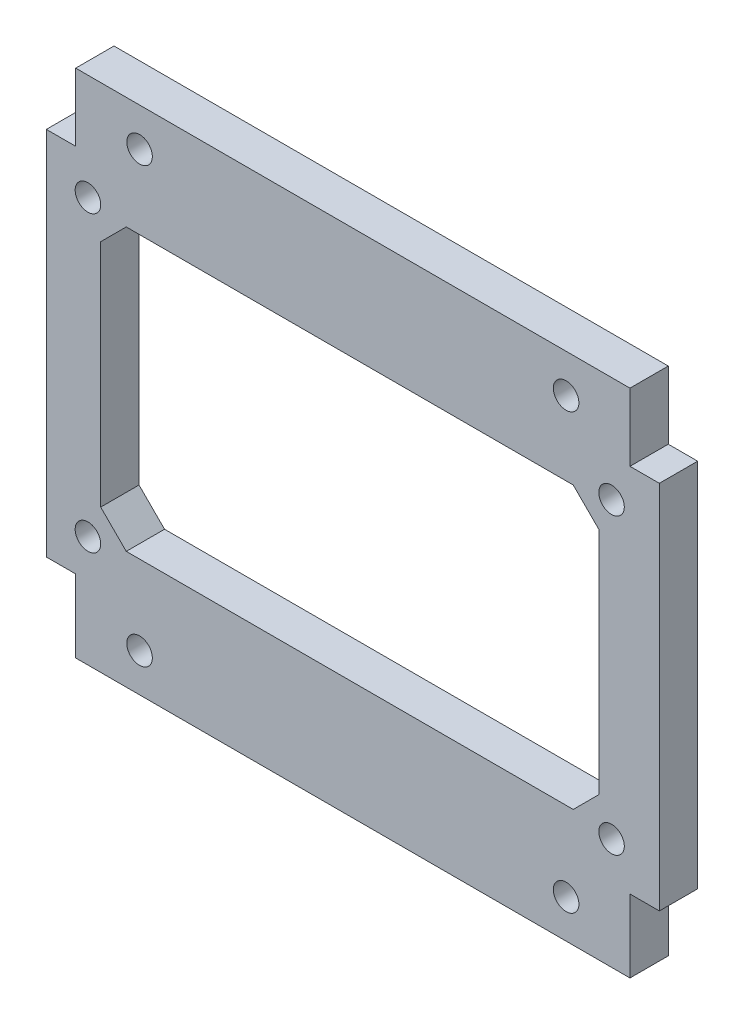
ISO-10303-21;
HEADER;
FILE_DESCRIPTION(('STEP AP214'),'2;1');
FILE_NAME('part.step','',(''),(''),'','','');
FILE_SCHEMA(('AUTOMOTIVE_DESIGN { 1 0 10303 214 1 1 1 1 }'));
ENDSEC;
DATA;
#1=APPLICATION_CONTEXT('core data for automotive mechanical design processes');
#2=APPLICATION_PROTOCOL_DEFINITION('international standard','automotive_design',2000,#1);
#3=PRODUCT_CONTEXT('',#1,'mechanical');
#4=PRODUCT('Part','Part','',(#3));
#5=PRODUCT_RELATED_PRODUCT_CATEGORY('part','',(#4));
#6=PRODUCT_DEFINITION_FORMATION('','',#4);
#7=PRODUCT_DEFINITION_CONTEXT('part definition',#1,'design');
#8=PRODUCT_DEFINITION('design','',#6,#7);
#9=PRODUCT_DEFINITION_SHAPE('','',#8);
#10=(LENGTH_UNIT() NAMED_UNIT(*) SI_UNIT(.MILLI.,.METRE.));
#11=(NAMED_UNIT(*) PLANE_ANGLE_UNIT() SI_UNIT($,.RADIAN.));
#12=(NAMED_UNIT(*) SI_UNIT($,.STERADIAN.) SOLID_ANGLE_UNIT());
#13=UNCERTAINTY_MEASURE_WITH_UNIT(LENGTH_MEASURE(1.E-05),#10,'distance_accuracy_value','');
#14=(GEOMETRIC_REPRESENTATION_CONTEXT(3) GLOBAL_UNCERTAINTY_ASSIGNED_CONTEXT((#13)) GLOBAL_UNIT_ASSIGNED_CONTEXT((#10,
#11,#12)) REPRESENTATION_CONTEXT('',''));
#15=CARTESIAN_POINT('',(0.,0.,0.));
#16=DIRECTION('',(0.,0.,1.));
#17=DIRECTION('',(1.,0.,0.));
#18=AXIS2_PLACEMENT_3D('',#15,#16,#17);
#19=CARTESIAN_POINT('',(2.7,0.,3.));
#20=DIRECTION('',(1.,0.,0.));
#21=DIRECTION('',(0.,0.,-1.));
#22=AXIS2_PLACEMENT_3D('',#19,#20,#21);
#23=PLANE('',#22);
#24=DIRECTION('',(0.,-1.,0.));
#25=VECTOR('',#24,1.);
#26=CARTESIAN_POINT('',(2.7,0.,3.));
#27=LINE('',#26,#25);
#28=CARTESIAN_POINT('',(2.7,34.6979555320925,3.));
#29=VERTEX_POINT('',#28);
#30=CARTESIAN_POINT('',(2.7,5.69795553209267,3.));
#31=VERTEX_POINT('',#30);
#32=EDGE_CURVE('E320',#29,#31,#27,.T.);
#33=ORIENTED_EDGE('',*,*,#32,.F.);
#34=DIRECTION('',(0.,0.,-1.));
#35=VECTOR('',#34,1.);
#36=CARTESIAN_POINT('',(2.7,34.6979555320925,3.));
#37=LINE('',#36,#35);
#38=CARTESIAN_POINT('',(2.7,34.6979555320925,0.));
#39=VERTEX_POINT('',#38);
#40=EDGE_CURVE('E247',#29,#39,#37,.T.);
#41=ORIENTED_EDGE('',*,*,#40,.T.);
#42=DIRECTION('',(0.,-1.,0.));
#43=VECTOR('',#42,1.);
#44=CARTESIAN_POINT('',(2.7,0.,0.));
#45=LINE('',#44,#43);
#46=CARTESIAN_POINT('',(2.7,5.69795553209267,0.));
#47=VERTEX_POINT('',#46);
#48=EDGE_CURVE('E317',#39,#47,#45,.T.);
#49=ORIENTED_EDGE('',*,*,#48,.T.);
#50=DIRECTION('',(0.,0.,1.));
#51=VECTOR('',#50,1.);
#52=CARTESIAN_POINT('',(2.7,5.69795553209267,3.));
#53=LINE('',#52,#51);
#54=EDGE_CURVE('E261',#47,#31,#53,.T.);
#55=ORIENTED_EDGE('',*,*,#54,.T.);
#56=EDGE_LOOP('',(#33,#41,#49,#55));
#57=FACE_BOUND('',#56,.T.);
#58=ADVANCED_FACE('F32',(#57),#23,.F.);
#59=CARTESIAN_POINT('',(2.7,0.,3.));
#60=DIRECTION('',(0.,1.,0.));
#61=DIRECTION('',(0.,0.,1.));
#62=AXIS2_PLACEMENT_3D('',#59,#60,#61);
#63=PLANE('',#62);
#64=DIRECTION('',(1.,0.,0.));
#65=VECTOR('',#64,1.);
#66=CARTESIAN_POINT('',(2.7,0.,3.));
#67=LINE('',#66,#65);
#68=CARTESIAN_POINT('',(4.99891138061809,0.,3.));
#69=VERTEX_POINT('',#68);
#70=CARTESIAN_POINT('',(48.3990927796002,0.,3.));
#71=VERTEX_POINT('',#70);
#72=EDGE_CURVE('E322',#69,#71,#67,.T.);
#73=ORIENTED_EDGE('',*,*,#72,.F.);
#74=DIRECTION('',(0.,0.,-1.));
#75=VECTOR('',#74,1.);
#76=CARTESIAN_POINT('',(4.99891138061809,0.,3.));
#77=LINE('',#76,#75);
#78=CARTESIAN_POINT('',(4.99891138061809,0.,0.));
#79=VERTEX_POINT('',#78);
#80=EDGE_CURVE('E264',#69,#79,#77,.T.);
#81=ORIENTED_EDGE('',*,*,#80,.T.);
#82=DIRECTION('',(1.,0.,0.));
#83=VECTOR('',#82,1.);
#84=CARTESIAN_POINT('',(2.7,0.,0.));
#85=LINE('',#84,#83);
#86=CARTESIAN_POINT('',(48.3990927796002,0.,0.));
#87=VERTEX_POINT('',#86);
#88=EDGE_CURVE('E332',#79,#87,#85,.T.);
#89=ORIENTED_EDGE('',*,*,#88,.T.);
#90=DIRECTION('',(0.,0.,1.));
#91=VECTOR('',#90,1.);
#92=CARTESIAN_POINT('',(48.3990927796002,0.,3.));
#93=LINE('',#92,#91);
#94=EDGE_CURVE('E278',#87,#71,#93,.T.);
#95=ORIENTED_EDGE('',*,*,#94,.T.);
#96=EDGE_LOOP('',(#73,#81,#89,#95));
#97=FACE_BOUND('',#96,.T.);
#98=ADVANCED_FACE('F374',(#97),#63,.F.);
#99=CARTESIAN_POINT('',(50.7,0.,3.));
#100=DIRECTION('',(-1.,0.,0.));
#101=DIRECTION('',(0.,0.,1.));
#102=AXIS2_PLACEMENT_3D('',#99,#100,#101);
#103=PLANE('',#102);
#104=DIRECTION('',(0.,1.,0.));
#105=VECTOR('',#104,1.);
#106=CARTESIAN_POINT('',(50.7,0.,3.));
#107=LINE('',#106,#105);
#108=CARTESIAN_POINT('',(50.7,5.69795553209267,3.));
#109=VERTEX_POINT('',#108);
#110=CARTESIAN_POINT('',(50.7,34.6979555320925,3.));
#111=VERTEX_POINT('',#110);
#112=EDGE_CURVE('E325',#109,#111,#107,.T.);
#113=ORIENTED_EDGE('',*,*,#112,.F.);
#114=DIRECTION('',(0.,0.,-1.));
#115=VECTOR('',#114,1.);
#116=CARTESIAN_POINT('',(50.7,5.69795553209267,3.));
#117=LINE('',#116,#115);
#118=CARTESIAN_POINT('',(50.7,5.69795553209268,0.));
#119=VERTEX_POINT('',#118);
#120=EDGE_CURVE('E275',#109,#119,#117,.T.);
#121=ORIENTED_EDGE('',*,*,#120,.T.);
#122=DIRECTION('',(0.,1.,0.));
#123=VECTOR('',#122,1.);
#124=CARTESIAN_POINT('',(50.7,0.,0.));
#125=LINE('',#124,#123);
#126=CARTESIAN_POINT('',(50.7,34.6979555320925,0.));
#127=VERTEX_POINT('',#126);
#128=EDGE_CURVE('E334',#119,#127,#125,.T.);
#129=ORIENTED_EDGE('',*,*,#128,.T.);
#130=DIRECTION('',(0.,0.,1.));
#131=VECTOR('',#130,1.);
#132=CARTESIAN_POINT('',(50.7,34.6979555320925,3.));
#133=LINE('',#132,#131);
#134=EDGE_CURVE('E289',#127,#111,#133,.T.);
#135=ORIENTED_EDGE('',*,*,#134,.T.);
#136=EDGE_LOOP('',(#113,#121,#129,#135));
#137=FACE_BOUND('',#136,.T.);
#138=ADVANCED_FACE('F387',(#137),#103,.F.);
#139=CARTESIAN_POINT('',(2.7,40.,3.));
#140=DIRECTION('',(0.,-1.,0.));
#141=DIRECTION('',(0.,0.,-1.));
#142=AXIS2_PLACEMENT_3D('',#139,#140,#141);
#143=PLANE('',#142);
#144=DIRECTION('',(-1.,0.,0.));
#145=VECTOR('',#144,1.);
#146=CARTESIAN_POINT('',(2.7,40.,0.));
#147=LINE('',#146,#145);
#148=CARTESIAN_POINT('',(48.3990927796002,40.,0.));
#149=VERTEX_POINT('',#148);
#150=CARTESIAN_POINT('',(4.99891138061809,40.,0.));
#151=VERTEX_POINT('',#150);
#152=EDGE_CURVE('E323',#149,#151,#147,.T.);
#153=ORIENTED_EDGE('',*,*,#152,.T.);
#154=DIRECTION('',(0.,0.,1.));
#155=VECTOR('',#154,1.);
#156=CARTESIAN_POINT('',(4.99891138061809,40.,3.));
#157=LINE('',#156,#155);
#158=CARTESIAN_POINT('',(4.99891138061809,40.,3.));
#159=VERTEX_POINT('',#158);
#160=EDGE_CURVE('E250',#151,#159,#157,.T.);
#161=ORIENTED_EDGE('',*,*,#160,.T.);
#162=DIRECTION('',(-1.,0.,0.));
#163=VECTOR('',#162,1.);
#164=CARTESIAN_POINT('',(2.7,40.,3.));
#165=LINE('',#164,#163);
#166=CARTESIAN_POINT('',(48.3990927796002,40.,3.));
#167=VERTEX_POINT('',#166);
#168=EDGE_CURVE('E327',#167,#159,#165,.T.);
#169=ORIENTED_EDGE('',*,*,#168,.F.);
#170=DIRECTION('',(0.,0.,-1.));
#171=VECTOR('',#170,1.);
#172=CARTESIAN_POINT('',(48.3990927796002,40.,3.));
#173=LINE('',#172,#171);
#174=EDGE_CURVE('E292',#167,#149,#173,.T.);
#175=ORIENTED_EDGE('',*,*,#174,.T.);
#176=EDGE_LOOP('',(#153,#161,#169,#175));
#177=FACE_BOUND('',#176,.T.);
#178=ADVANCED_FACE('F399',(#177),#143,.F.);
#179=CARTESIAN_POINT('',(2.7,40.,3.));
#180=DIRECTION('',(0.,0.,-1.));
#181=DIRECTION('',(-1.,0.,0.));
#182=AXIS2_PLACEMENT_3D('',#179,#180,#181);
#183=PLANE('',#182);
#184=CARTESIAN_POINT('',(5.95692774112712,8.70969891146358,3.));
#185=DIRECTION('',(0.,0.,1.));
#186=DIRECTION('',(1.,0.,0.));
#187=AXIS2_PLACEMENT_3D('',#184,#185,#186);
#188=CIRCLE('',#187,1.);
#189=CARTESIAN_POINT('',(6.95692774112712,8.70969891146358,3.));
#190=VERTEX_POINT('',#189);
#191=EDGE_CURVE('E611',#190,#190,#188,.T.);
#192=ORIENTED_EDGE('',*,*,#191,.F.);
#193=EDGE_LOOP('',(#192));
#194=FACE_BOUND('',#193,.T.);
#195=CARTESIAN_POINT('',(46.9569277411271,8.7096989114636,3.));
#196=DIRECTION('',(0.,0.,1.));
#197=DIRECTION('',(1.,0.,0.));
#198=AXIS2_PLACEMENT_3D('',#195,#196,#197);
#199=CIRCLE('',#198,0.999999999999998);
#200=CARTESIAN_POINT('',(47.9569277411271,8.7096989114636,3.));
#201=VERTEX_POINT('',#200);
#202=EDGE_CURVE('E613',#201,#201,#199,.T.);
#203=ORIENTED_EDGE('',*,*,#202,.F.);
#204=EDGE_LOOP('',(#203));
#205=FACE_BOUND('',#204,.T.);
#206=CARTESIAN_POINT('',(46.9569277411271,31.7096989114636,3.));
#207=DIRECTION('',(0.,0.,1.));
#208=DIRECTION('',(1.,0.,0.));
#209=AXIS2_PLACEMENT_3D('',#206,#207,#208);
#210=CIRCLE('',#209,0.998470841288108);
#211=CARTESIAN_POINT('',(47.9553985824152,31.7096989114636,3.));
#212=VERTEX_POINT('',#211);
#213=EDGE_CURVE('E619',#212,#212,#210,.T.);
#214=ORIENTED_EDGE('',*,*,#213,.F.);
#215=EDGE_LOOP('',(#214));
#216=FACE_BOUND('',#215,.T.);
#217=CARTESIAN_POINT('',(5.95692774112712,31.7096989114636,3.));
#218=DIRECTION('',(0.,0.,1.));
#219=DIRECTION('',(1.,0.,0.));
#220=AXIS2_PLACEMENT_3D('',#217,#218,#219);
#221=CIRCLE('',#220,1.);
#222=CARTESIAN_POINT('',(6.95692774112712,31.7096989114636,3.));
#223=VERTEX_POINT('',#222);
#224=EDGE_CURVE('E193',#223,#223,#221,.T.);
#225=ORIENTED_EDGE('',*,*,#224,.F.);
#226=EDGE_LOOP('',(#225));
#227=FACE_BOUND('',#226,.T.);
#228=DIRECTION('',(-0.707106781186547,-0.707106781186548,0.));
#229=VECTOR('',#228,1.);
#230=CARTESIAN_POINT('',(8.95692774112712,31.2096989114636,3.));
#231=LINE('',#230,#229);
#232=CARTESIAN_POINT('',(8.95692774112711,31.2096989114636,3.));
#233=VERTEX_POINT('',#232);
#234=CARTESIAN_POINT('',(6.95692774112712,29.2096989114636,3.));
#235=VERTEX_POINT('',#234);
#236=EDGE_CURVE('E210',#233,#235,#231,.T.);
#237=ORIENTED_EDGE('',*,*,#236,.F.);
#238=DIRECTION('',(-1.,0.,0.));
#239=VECTOR('',#238,1.);
#240=CARTESIAN_POINT('',(43.9569277411271,31.2096989114636,3.));
#241=LINE('',#240,#239);
#242=CARTESIAN_POINT('',(43.9569277411271,31.2096989114636,3.));
#243=VERTEX_POINT('',#242);
#244=EDGE_CURVE('E46',#243,#233,#241,.T.);
#245=ORIENTED_EDGE('',*,*,#244,.F.);
#246=DIRECTION('',(-0.707106781186548,0.707106781186547,0.));
#247=VECTOR('',#246,1.);
#248=CARTESIAN_POINT('',(45.9569277411271,29.2096989114636,3.));
#249=LINE('',#248,#247);
#250=CARTESIAN_POINT('',(45.9569277411271,29.2096989114636,3.));
#251=VERTEX_POINT('',#250);
#252=EDGE_CURVE('E187',#251,#243,#249,.T.);
#253=ORIENTED_EDGE('',*,*,#252,.F.);
#254=DIRECTION('',(0.,1.,0.));
#255=VECTOR('',#254,1.);
#256=CARTESIAN_POINT('',(45.9569277411271,11.2096989114636,3.));
#257=LINE('',#256,#255);
#258=CARTESIAN_POINT('',(45.9569277411271,11.2096989114636,3.));
#259=VERTEX_POINT('',#258);
#260=EDGE_CURVE('E190',#259,#251,#257,.T.);
#261=ORIENTED_EDGE('',*,*,#260,.F.);
#262=DIRECTION('',(0.707106781186547,0.707106781186547,0.));
#263=VECTOR('',#262,1.);
#264=CARTESIAN_POINT('',(43.9569277411271,9.20969891146358,3.));
#265=LINE('',#264,#263);
#266=CARTESIAN_POINT('',(43.9569277411271,9.20969891146358,3.));
#267=VERTEX_POINT('',#266);
#268=EDGE_CURVE('E222',#267,#259,#265,.T.);
#269=ORIENTED_EDGE('',*,*,#268,.F.);
#270=DIRECTION('',(1.,0.,0.));
#271=VECTOR('',#270,1.);
#272=CARTESIAN_POINT('',(8.95692774112712,9.20969891146358,3.));
#273=LINE('',#272,#271);
#274=CARTESIAN_POINT('',(8.95692774112712,9.20969891146358,3.));
#275=VERTEX_POINT('',#274);
#276=EDGE_CURVE('E219',#275,#267,#273,.T.);
#277=ORIENTED_EDGE('',*,*,#276,.F.);
#278=DIRECTION('',(0.707106781186547,-0.707106781186548,0.));
#279=VECTOR('',#278,1.);
#280=CARTESIAN_POINT('',(6.95692774112712,11.2096989114636,3.));
#281=LINE('',#280,#279);
#282=CARTESIAN_POINT('',(6.95692774112712,11.2096989114636,3.));
#283=VERTEX_POINT('',#282);
#284=EDGE_CURVE('E216',#283,#275,#281,.T.);
#285=ORIENTED_EDGE('',*,*,#284,.F.);
#286=DIRECTION('',(0.,-1.,0.));
#287=VECTOR('',#286,1.);
#288=CARTESIAN_POINT('',(6.95692774112712,29.2096989114636,3.));
#289=LINE('',#288,#287);
#290=EDGE_CURVE('E213',#235,#283,#289,.T.);
#291=ORIENTED_EDGE('',*,*,#290,.F.);
#292=EDGE_LOOP('',(#237,#245,#253,#261,#269,#277,#285,#291));
#293=FACE_BOUND('',#292,.T.);
#294=CARTESIAN_POINT('',(43.4,37.,3.));
#295=DIRECTION('',(0.,0.,1.));
#296=DIRECTION('',(-1.,0.,0.));
#297=AXIS2_PLACEMENT_3D('',#294,#295,#296);
#298=CIRCLE('',#297,0.999999999999992);
#299=CARTESIAN_POINT('',(42.4,37.,3.));
#300=VERTEX_POINT('',#299);
#301=EDGE_CURVE('E295',#300,#300,#298,.T.);
#302=ORIENTED_EDGE('',*,*,#301,.F.);
#303=EDGE_LOOP('',(#302));
#304=FACE_BOUND('',#303,.T.);
#305=CARTESIAN_POINT('',(43.4,3.00000000000001,3.));
#306=DIRECTION('',(0.,0.,1.));
#307=DIRECTION('',(1.,0.,0.));
#308=AXIS2_PLACEMENT_3D('',#305,#306,#307);
#309=CIRCLE('',#308,0.999999999999998);
#310=CARTESIAN_POINT('',(44.4,3.00000000000001,3.));
#311=VERTEX_POINT('',#310);
#312=EDGE_CURVE('E299',#311,#311,#309,.T.);
#313=ORIENTED_EDGE('',*,*,#312,.F.);
#314=EDGE_LOOP('',(#313));
#315=FACE_BOUND('',#314,.T.);
#316=CARTESIAN_POINT('',(10.,3.00000000000001,3.));
#317=DIRECTION('',(0.,0.,1.));
#318=DIRECTION('',(-1.,0.,0.));
#319=AXIS2_PLACEMENT_3D('',#316,#317,#318);
#320=CIRCLE('',#319,1.);
#321=CARTESIAN_POINT('',(9.,3.00000000000001,3.));
#322=VERTEX_POINT('',#321);
#323=EDGE_CURVE('E305',#322,#322,#320,.T.);
#324=ORIENTED_EDGE('',*,*,#323,.F.);
#325=EDGE_LOOP('',(#324));
#326=FACE_BOUND('',#325,.T.);
#327=CARTESIAN_POINT('',(9.99999999999999,37.,3.));
#328=DIRECTION('',(0.,0.,1.));
#329=DIRECTION('',(1.,0.,0.));
#330=AXIS2_PLACEMENT_3D('',#327,#328,#329);
#331=CIRCLE('',#330,0.999999999999992);
#332=CARTESIAN_POINT('',(11.,37.,3.));
#333=VERTEX_POINT('',#332);
#334=EDGE_CURVE('E311',#333,#333,#331,.T.);
#335=ORIENTED_EDGE('',*,*,#334,.F.);
#336=EDGE_LOOP('',(#335));
#337=FACE_BOUND('',#336,.T.);
#338=ORIENTED_EDGE('',*,*,#168,.T.);
#339=DIRECTION('',(0.,1.,0.));
#340=VECTOR('',#339,1.);
#341=CARTESIAN_POINT('',(4.99891138061809,34.6979555320925,3.));
#342=LINE('',#341,#340);
#343=CARTESIAN_POINT('',(4.99891138061809,34.6979555320925,3.));
#344=VERTEX_POINT('',#343);
#345=EDGE_CURVE('E229',#344,#159,#342,.T.);
#346=ORIENTED_EDGE('',*,*,#345,.F.);
#347=DIRECTION('',(1.,0.,0.));
#348=VECTOR('',#347,1.);
#349=CARTESIAN_POINT('',(4.99891138061809,34.6979555320925,3.));
#350=LINE('',#349,#348);
#351=EDGE_CURVE('E242',#29,#344,#350,.T.);
#352=ORIENTED_EDGE('',*,*,#351,.F.);
#353=ORIENTED_EDGE('',*,*,#32,.T.);
#354=DIRECTION('',(-1.,0.,0.));
#355=VECTOR('',#354,1.);
#356=CARTESIAN_POINT('',(4.99891138061809,5.69795553209267,3.));
#357=LINE('',#356,#355);
#358=CARTESIAN_POINT('',(4.99891138061809,5.69795553209267,3.));
#359=VERTEX_POINT('',#358);
#360=EDGE_CURVE('E255',#359,#31,#357,.T.);
#361=ORIENTED_EDGE('',*,*,#360,.F.);
#362=DIRECTION('',(0.,1.,0.));
#363=VECTOR('',#362,1.);
#364=CARTESIAN_POINT('',(4.99891138061809,5.69795553209267,3.));
#365=LINE('',#364,#363);
#366=EDGE_CURVE('E253',#69,#359,#365,.T.);
#367=ORIENTED_EDGE('',*,*,#366,.F.);
#368=ORIENTED_EDGE('',*,*,#72,.T.);
#369=DIRECTION('',(0.,-1.,0.));
#370=VECTOR('',#369,1.);
#371=CARTESIAN_POINT('',(48.3990927796002,5.69795553209267,3.));
#372=LINE('',#371,#370);
#373=CARTESIAN_POINT('',(48.3990927796002,5.69795553209267,3.));
#374=VERTEX_POINT('',#373);
#375=EDGE_CURVE('E267',#374,#71,#372,.T.);
#376=ORIENTED_EDGE('',*,*,#375,.F.);
#377=DIRECTION('',(-1.,0.,0.));
#378=VECTOR('',#377,1.);
#379=CARTESIAN_POINT('',(48.3990927796002,5.69795553209267,3.));
#380=LINE('',#379,#378);
#381=EDGE_CURVE('E270',#109,#374,#380,.T.);
#382=ORIENTED_EDGE('',*,*,#381,.F.);
#383=ORIENTED_EDGE('',*,*,#112,.T.);
#384=DIRECTION('',(1.,0.,0.));
#385=VECTOR('',#384,1.);
#386=CARTESIAN_POINT('',(48.3990927796002,34.6979555320925,3.));
#387=LINE('',#386,#385);
#388=CARTESIAN_POINT('',(48.3990927796002,34.6979555320925,3.));
#389=VERTEX_POINT('',#388);
#390=EDGE_CURVE('E283',#389,#111,#387,.T.);
#391=ORIENTED_EDGE('',*,*,#390,.F.);
#392=DIRECTION('',(0.,-1.,0.));
#393=VECTOR('',#392,1.);
#394=CARTESIAN_POINT('',(48.3990927796002,34.6979555320925,3.));
#395=LINE('',#394,#393);
#396=EDGE_CURVE('E281',#167,#389,#395,.T.);
#397=ORIENTED_EDGE('',*,*,#396,.F.);
#398=EDGE_LOOP('',(#338,#346,#352,#353,#361,#367,#368,#376,#382,#383,#391,#397));
#399=FACE_BOUND('',#398,.T.);
#400=ADVANCED_FACE('F371',(#194,#205,#216,#227,#293,#304,#315,#326,#337,#399),#183,.F.);
#401=CARTESIAN_POINT('',(2.7,40.,0.));
#402=DIRECTION('',(0.,0.,-1.));
#403=DIRECTION('',(-1.,0.,0.));
#404=AXIS2_PLACEMENT_3D('',#401,#402,#403);
#405=PLANE('',#404);
#406=CARTESIAN_POINT('',(5.95692774112712,8.70969891146358,0.));
#407=DIRECTION('',(0.,0.,1.));
#408=DIRECTION('',(1.,0.,0.));
#409=AXIS2_PLACEMENT_3D('',#406,#407,#408);
#410=CIRCLE('',#409,1.);
#411=CARTESIAN_POINT('',(6.95692774112712,8.70969891146358,0.));
#412=VERTEX_POINT('',#411);
#413=EDGE_CURVE('E608',#412,#412,#410,.T.);
#414=ORIENTED_EDGE('',*,*,#413,.T.);
#415=EDGE_LOOP('',(#414));
#416=FACE_BOUND('',#415,.T.);
#417=CARTESIAN_POINT('',(46.9569277411271,8.7096989114636,0.));
#418=DIRECTION('',(0.,0.,1.));
#419=DIRECTION('',(1.,0.,0.));
#420=AXIS2_PLACEMENT_3D('',#417,#418,#419);
#421=CIRCLE('',#420,0.999999999999998);
#422=CARTESIAN_POINT('',(47.9569277411271,8.7096989114636,0.));
#423=VERTEX_POINT('',#422);
#424=EDGE_CURVE('E616',#423,#423,#421,.T.);
#425=ORIENTED_EDGE('',*,*,#424,.T.);
#426=EDGE_LOOP('',(#425));
#427=FACE_BOUND('',#426,.T.);
#428=CARTESIAN_POINT('',(46.9569277411271,31.7096989114636,0.));
#429=DIRECTION('',(0.,0.,1.));
#430=DIRECTION('',(1.,0.,0.));
#431=AXIS2_PLACEMENT_3D('',#428,#429,#430);
#432=CIRCLE('',#431,0.998470841288108);
#433=CARTESIAN_POINT('',(47.9553985824152,31.7096989114636,0.));
#434=VERTEX_POINT('',#433);
#435=EDGE_CURVE('E622',#434,#434,#432,.T.);
#436=ORIENTED_EDGE('',*,*,#435,.T.);
#437=EDGE_LOOP('',(#436));
#438=FACE_BOUND('',#437,.T.);
#439=CARTESIAN_POINT('',(5.95692774112712,31.7096989114636,0.));
#440=DIRECTION('',(0.,0.,1.));
#441=DIRECTION('',(1.,0.,0.));
#442=AXIS2_PLACEMENT_3D('',#439,#440,#441);
#443=CIRCLE('',#442,1.);
#444=CARTESIAN_POINT('',(6.95692774112712,31.7096989114636,0.));
#445=VERTEX_POINT('',#444);
#446=EDGE_CURVE('E211',#445,#445,#443,.T.);
#447=ORIENTED_EDGE('',*,*,#446,.T.);
#448=EDGE_LOOP('',(#447));
#449=FACE_BOUND('',#448,.T.);
#450=DIRECTION('',(-1.,0.,0.));
#451=VECTOR('',#450,1.);
#452=CARTESIAN_POINT('',(43.9569277411271,31.2096989114636,0.));
#453=LINE('',#452,#451);
#454=CARTESIAN_POINT('',(43.9569277411271,31.2096989114636,0.));
#455=VERTEX_POINT('',#454);
#456=CARTESIAN_POINT('',(8.95692774112712,31.2096989114636,0.));
#457=VERTEX_POINT('',#456);
#458=EDGE_CURVE('E170',#455,#457,#453,.T.);
#459=ORIENTED_EDGE('',*,*,#458,.T.);
#460=DIRECTION('',(-0.707106781186547,-0.707106781186548,0.));
#461=VECTOR('',#460,1.);
#462=CARTESIAN_POINT('',(8.95692774112712,31.2096989114636,0.));
#463=LINE('',#462,#461);
#464=CARTESIAN_POINT('',(6.95692774112712,29.2096989114636,0.));
#465=VERTEX_POINT('',#464);
#466=EDGE_CURVE('E179',#457,#465,#463,.T.);
#467=ORIENTED_EDGE('',*,*,#466,.T.);
#468=DIRECTION('',(0.,-1.,0.));
#469=VECTOR('',#468,1.);
#470=CARTESIAN_POINT('',(6.95692774112712,29.2096989114636,0.));
#471=LINE('',#470,#469);
#472=CARTESIAN_POINT('',(6.95692774112712,11.2096989114636,0.));
#473=VERTEX_POINT('',#472);
#474=EDGE_CURVE('E54',#465,#473,#471,.T.);
#475=ORIENTED_EDGE('',*,*,#474,.T.);
#476=DIRECTION('',(0.707106781186547,-0.707106781186548,0.));
#477=VECTOR('',#476,1.);
#478=CARTESIAN_POINT('',(6.95692774112712,11.2096989114636,0.));
#479=LINE('',#478,#477);
#480=CARTESIAN_POINT('',(8.95692774112712,9.20969891146358,0.));
#481=VERTEX_POINT('',#480);
#482=EDGE_CURVE('E197',#473,#481,#479,.T.);
#483=ORIENTED_EDGE('',*,*,#482,.T.);
#484=DIRECTION('',(1.,0.,0.));
#485=VECTOR('',#484,1.);
#486=CARTESIAN_POINT('',(8.95692774112712,9.20969891146358,0.));
#487=LINE('',#486,#485);
#488=CARTESIAN_POINT('',(43.9569277411271,9.20969891146358,0.));
#489=VERTEX_POINT('',#488);
#490=EDGE_CURVE('E200',#481,#489,#487,.T.);
#491=ORIENTED_EDGE('',*,*,#490,.T.);
#492=DIRECTION('',(0.707106781186547,0.707106781186547,0.));
#493=VECTOR('',#492,1.);
#494=CARTESIAN_POINT('',(43.9569277411271,9.20969891146358,0.));
#495=LINE('',#494,#493);
#496=CARTESIAN_POINT('',(45.9569277411271,11.2096989114636,0.));
#497=VERTEX_POINT('',#496);
#498=EDGE_CURVE('E203',#489,#497,#495,.T.);
#499=ORIENTED_EDGE('',*,*,#498,.T.);
#500=DIRECTION('',(0.,1.,0.));
#501=VECTOR('',#500,1.);
#502=CARTESIAN_POINT('',(45.9569277411271,11.2096989114636,0.));
#503=LINE('',#502,#501);
#504=CARTESIAN_POINT('',(45.9569277411271,29.2096989114636,0.));
#505=VERTEX_POINT('',#504);
#506=EDGE_CURVE('E206',#497,#505,#503,.T.);
#507=ORIENTED_EDGE('',*,*,#506,.T.);
#508=DIRECTION('',(-0.707106781186548,0.707106781186547,0.));
#509=VECTOR('',#508,1.);
#510=CARTESIAN_POINT('',(45.9569277411271,29.2096989114636,0.));
#511=LINE('',#510,#509);
#512=EDGE_CURVE('E176',#505,#455,#511,.T.);
#513=ORIENTED_EDGE('',*,*,#512,.T.);
#514=EDGE_LOOP('',(#459,#467,#475,#483,#491,#499,#507,#513));
#515=FACE_BOUND('',#514,.T.);
#516=DIRECTION('',(0.,-1.,0.));
#517=VECTOR('',#516,1.);
#518=CARTESIAN_POINT('',(4.99891138061809,40.,0.));
#519=LINE('',#518,#517);
#520=CARTESIAN_POINT('',(4.99891138061809,34.6979555320925,0.));
#521=VERTEX_POINT('',#520);
#522=EDGE_CURVE('E11',#151,#521,#519,.T.);
#523=ORIENTED_EDGE('',*,*,#522,.F.);
#524=ORIENTED_EDGE('',*,*,#152,.F.);
#525=DIRECTION('',(0.,1.,0.));
#526=VECTOR('',#525,1.);
#527=CARTESIAN_POINT('',(48.3990927796002,40.,0.));
#528=LINE('',#527,#526);
#529=CARTESIAN_POINT('',(48.3990927796002,34.6979555320925,0.));
#530=VERTEX_POINT('',#529);
#531=EDGE_CURVE('E339',#530,#149,#528,.T.);
#532=ORIENTED_EDGE('',*,*,#531,.F.);
#533=DIRECTION('',(-1.,0.,0.));
#534=VECTOR('',#533,1.);
#535=CARTESIAN_POINT('',(2.7,34.6979555320925,0.));
#536=LINE('',#535,#534);
#537=EDGE_CURVE('E330',#127,#530,#536,.T.);
#538=ORIENTED_EDGE('',*,*,#537,.F.);
#539=ORIENTED_EDGE('',*,*,#128,.F.);
#540=DIRECTION('',(1.,0.,0.));
#541=VECTOR('',#540,1.);
#542=CARTESIAN_POINT('',(2.7,5.69795553209268,0.));
#543=LINE('',#542,#541);
#544=CARTESIAN_POINT('',(48.3990927796002,5.69795553209268,0.));
#545=VERTEX_POINT('',#544);
#546=EDGE_CURVE('E341',#545,#119,#543,.T.);
#547=ORIENTED_EDGE('',*,*,#546,.F.);
#548=DIRECTION('',(0.,1.,0.));
#549=VECTOR('',#548,1.);
#550=CARTESIAN_POINT('',(48.3990927796002,40.,0.));
#551=LINE('',#550,#549);
#552=EDGE_CURVE('E343',#87,#545,#551,.T.);
#553=ORIENTED_EDGE('',*,*,#552,.F.);
#554=ORIENTED_EDGE('',*,*,#88,.F.);
#555=DIRECTION('',(0.,-1.,0.));
#556=VECTOR('',#555,1.);
#557=CARTESIAN_POINT('',(4.99891138061808,40.,0.));
#558=LINE('',#557,#556);
#559=CARTESIAN_POINT('',(4.99891138061809,5.69795553209267,0.));
#560=VERTEX_POINT('',#559);
#561=EDGE_CURVE('E348',#560,#79,#558,.T.);
#562=ORIENTED_EDGE('',*,*,#561,.F.);
#563=DIRECTION('',(1.,0.,0.));
#564=VECTOR('',#563,1.);
#565=CARTESIAN_POINT('',(2.7,5.69795553209267,0.));
#566=LINE('',#565,#564);
#567=EDGE_CURVE('E346',#47,#560,#566,.T.);
#568=ORIENTED_EDGE('',*,*,#567,.F.);
#569=ORIENTED_EDGE('',*,*,#48,.F.);
#570=DIRECTION('',(-1.,0.,0.));
#571=VECTOR('',#570,1.);
#572=CARTESIAN_POINT('',(2.7,34.6979555320925,0.));
#573=LINE('',#572,#571);
#574=EDGE_CURVE('E39',#521,#39,#573,.T.);
#575=ORIENTED_EDGE('',*,*,#574,.F.);
#576=EDGE_LOOP('',(#523,#524,#532,#538,#539,#547,#553,#554,#562,#568,#569,#575));
#577=FACE_BOUND('',#576,.T.);
#578=CARTESIAN_POINT('',(43.4,37.,0.));
#579=DIRECTION('',(0.,0.,1.));
#580=DIRECTION('',(-1.,0.,0.));
#581=AXIS2_PLACEMENT_3D('',#578,#579,#580);
#582=CIRCLE('',#581,0.999999999999992);
#583=CARTESIAN_POINT('',(42.4,37.,0.));
#584=VERTEX_POINT('',#583);
#585=EDGE_CURVE('E296',#584,#584,#582,.T.);
#586=ORIENTED_EDGE('',*,*,#585,.T.);
#587=EDGE_LOOP('',(#586));
#588=FACE_BOUND('',#587,.T.);
#589=CARTESIAN_POINT('',(43.4,3.00000000000001,0.));
#590=DIRECTION('',(0.,0.,1.));
#591=DIRECTION('',(1.,0.,0.));
#592=AXIS2_PLACEMENT_3D('',#589,#590,#591);
#593=CIRCLE('',#592,0.999999999999998);
#594=CARTESIAN_POINT('',(44.4,3.00000000000001,0.));
#595=VERTEX_POINT('',#594);
#596=EDGE_CURVE('E302',#595,#595,#593,.T.);
#597=ORIENTED_EDGE('',*,*,#596,.T.);
#598=EDGE_LOOP('',(#597));
#599=FACE_BOUND('',#598,.T.);
#600=CARTESIAN_POINT('',(10.,3.00000000000001,0.));
#601=DIRECTION('',(0.,0.,1.));
#602=DIRECTION('',(-1.,0.,0.));
#603=AXIS2_PLACEMENT_3D('',#600,#601,#602);
#604=CIRCLE('',#603,1.);
#605=CARTESIAN_POINT('',(9.,3.00000000000001,0.));
#606=VERTEX_POINT('',#605);
#607=EDGE_CURVE('E308',#606,#606,#604,.T.);
#608=ORIENTED_EDGE('',*,*,#607,.T.);
#609=EDGE_LOOP('',(#608));
#610=FACE_BOUND('',#609,.T.);
#611=CARTESIAN_POINT('',(9.99999999999999,37.,0.));
#612=DIRECTION('',(0.,0.,1.));
#613=DIRECTION('',(1.,0.,0.));
#614=AXIS2_PLACEMENT_3D('',#611,#612,#613);
#615=CIRCLE('',#614,0.999999999999992);
#616=CARTESIAN_POINT('',(11.,37.,0.));
#617=VERTEX_POINT('',#616);
#618=EDGE_CURVE('E314',#617,#617,#615,.T.);
#619=ORIENTED_EDGE('',*,*,#618,.T.);
#620=EDGE_LOOP('',(#619));
#621=FACE_BOUND('',#620,.T.);
#622=ADVANCED_FACE('F183',(#416,#427,#438,#449,#515,#577,#588,#599,#610,#621),#405,.T.);
#623=CARTESIAN_POINT('',(9.99999999999999,37.,0.));
#624=DIRECTION('',(0.,0.,1.));
#625=DIRECTION('',(1.,0.,0.));
#626=AXIS2_PLACEMENT_3D('',#623,#624,#625);
#627=CYLINDRICAL_SURFACE('',#626,0.999999999999992);
#628=ORIENTED_EDGE('',*,*,#618,.F.);
#629=EDGE_LOOP('',(#628));
#630=FACE_BOUND('',#629,.T.);
#631=ORIENTED_EDGE('',*,*,#334,.T.);
#632=EDGE_LOOP('',(#631));
#633=FACE_BOUND('',#632,.T.);
#634=ADVANCED_FACE('F425',(#630,#633),#627,.F.);
#635=CARTESIAN_POINT('',(10.,3.00000000000001,0.));
#636=DIRECTION('',(0.,0.,1.));
#637=DIRECTION('',(1.,0.,0.));
#638=AXIS2_PLACEMENT_3D('',#635,#636,#637);
#639=CYLINDRICAL_SURFACE('',#638,1.);
#640=ORIENTED_EDGE('',*,*,#607,.F.);
#641=EDGE_LOOP('',(#640));
#642=FACE_BOUND('',#641,.T.);
#643=ORIENTED_EDGE('',*,*,#323,.T.);
#644=EDGE_LOOP('',(#643));
#645=FACE_BOUND('',#644,.T.);
#646=ADVANCED_FACE('F432',(#642,#645),#639,.F.);
#647=CARTESIAN_POINT('',(43.4,3.00000000000001,0.));
#648=DIRECTION('',(0.,0.,1.));
#649=DIRECTION('',(1.,0.,0.));
#650=AXIS2_PLACEMENT_3D('',#647,#648,#649);
#651=CYLINDRICAL_SURFACE('',#650,0.999999999999998);
#652=ORIENTED_EDGE('',*,*,#596,.F.);
#653=EDGE_LOOP('',(#652));
#654=FACE_BOUND('',#653,.T.);
#655=ORIENTED_EDGE('',*,*,#312,.T.);
#656=EDGE_LOOP('',(#655));
#657=FACE_BOUND('',#656,.T.);
#658=ADVANCED_FACE('F436',(#654,#657),#651,.F.);
#659=CARTESIAN_POINT('',(43.4,37.,0.));
#660=DIRECTION('',(0.,0.,1.));
#661=DIRECTION('',(1.,0.,0.));
#662=AXIS2_PLACEMENT_3D('',#659,#660,#661);
#663=CYLINDRICAL_SURFACE('',#662,0.999999999999992);
#664=ORIENTED_EDGE('',*,*,#585,.F.);
#665=EDGE_LOOP('',(#664));
#666=FACE_BOUND('',#665,.T.);
#667=ORIENTED_EDGE('',*,*,#301,.T.);
#668=EDGE_LOOP('',(#667));
#669=FACE_BOUND('',#668,.T.);
#670=ADVANCED_FACE('F440',(#666,#669),#663,.F.);
#671=CARTESIAN_POINT('',(48.3990927796002,34.6979555320925,-7.));
#672=DIRECTION('',(-1.,0.,0.));
#673=DIRECTION('',(0.,0.,1.));
#674=AXIS2_PLACEMENT_3D('',#671,#672,#673);
#675=PLANE('',#674);
#676=ORIENTED_EDGE('',*,*,#396,.T.);
#677=DIRECTION('',(0.,0.,1.));
#678=VECTOR('',#677,1.);
#679=CARTESIAN_POINT('',(48.3990927796002,34.6979555320925,-7.));
#680=LINE('',#679,#678);
#681=EDGE_CURVE('E286',#530,#389,#680,.T.);
#682=ORIENTED_EDGE('',*,*,#681,.F.);
#683=ORIENTED_EDGE('',*,*,#531,.T.);
#684=ORIENTED_EDGE('',*,*,#174,.F.);
#685=EDGE_LOOP('',(#676,#682,#683,#684));
#686=FACE_BOUND('',#685,.T.);
#687=ADVANCED_FACE('F396',(#686),#675,.F.);
#688=CARTESIAN_POINT('',(48.3990927796002,34.6979555320925,-7.));
#689=DIRECTION('',(0.,-1.,0.));
#690=DIRECTION('',(0.,0.,-1.));
#691=AXIS2_PLACEMENT_3D('',#688,#689,#690);
#692=PLANE('',#691);
#693=ORIENTED_EDGE('',*,*,#537,.T.);
#694=ORIENTED_EDGE('',*,*,#681,.T.);
#695=ORIENTED_EDGE('',*,*,#390,.T.);
#696=ORIENTED_EDGE('',*,*,#134,.F.);
#697=EDGE_LOOP('',(#693,#694,#695,#696));
#698=FACE_BOUND('',#697,.T.);
#699=ADVANCED_FACE('F392',(#698),#692,.F.);
#700=CARTESIAN_POINT('',(48.3990927796002,5.69795553209267,-7.));
#701=DIRECTION('',(-1.,0.,0.));
#702=DIRECTION('',(0.,0.,1.));
#703=AXIS2_PLACEMENT_3D('',#700,#701,#702);
#704=PLANE('',#703);
#705=ORIENTED_EDGE('',*,*,#552,.T.);
#706=DIRECTION('',(0.,0.,1.));
#707=VECTOR('',#706,1.);
#708=CARTESIAN_POINT('',(48.3990927796002,5.69795553209267,-7.));
#709=LINE('',#708,#707);
#710=EDGE_CURVE('E273',#545,#374,#709,.T.);
#711=ORIENTED_EDGE('',*,*,#710,.T.);
#712=ORIENTED_EDGE('',*,*,#375,.T.);
#713=ORIENTED_EDGE('',*,*,#94,.F.);
#714=EDGE_LOOP('',(#705,#711,#712,#713));
#715=FACE_BOUND('',#714,.T.);
#716=ADVANCED_FACE('F378',(#715),#704,.F.);
#717=CARTESIAN_POINT('',(48.3990927796002,5.69795553209267,-7.));
#718=DIRECTION('',(0.,1.,0.));
#719=DIRECTION('',(-1.,0.,0.));
#720=AXIS2_PLACEMENT_3D('',#717,#718,#719);
#721=PLANE('',#720);
#722=ORIENTED_EDGE('',*,*,#381,.T.);
#723=ORIENTED_EDGE('',*,*,#710,.F.);
#724=ORIENTED_EDGE('',*,*,#546,.T.);
#725=ORIENTED_EDGE('',*,*,#120,.F.);
#726=EDGE_LOOP('',(#722,#723,#724,#725));
#727=FACE_BOUND('',#726,.T.);
#728=ADVANCED_FACE('F383',(#727),#721,.F.);
#729=CARTESIAN_POINT('',(4.99891138061809,5.69795553209267,-7.));
#730=DIRECTION('',(1.,0.,0.));
#731=DIRECTION('',(0.,1.,0.));
#732=AXIS2_PLACEMENT_3D('',#729,#730,#731);
#733=PLANE('',#732);
#734=ORIENTED_EDGE('',*,*,#366,.T.);
#735=DIRECTION('',(0.,0.,1.));
#736=VECTOR('',#735,1.);
#737=CARTESIAN_POINT('',(4.99891138061809,5.69795553209267,-7.));
#738=LINE('',#737,#736);
#739=EDGE_CURVE('E258',#560,#359,#738,.T.);
#740=ORIENTED_EDGE('',*,*,#739,.F.);
#741=ORIENTED_EDGE('',*,*,#561,.T.);
#742=ORIENTED_EDGE('',*,*,#80,.F.);
#743=EDGE_LOOP('',(#734,#740,#741,#742));
#744=FACE_BOUND('',#743,.T.);
#745=ADVANCED_FACE('F367',(#744),#733,.F.);
#746=CARTESIAN_POINT('',(4.99891138061809,5.69795553209267,-7.));
#747=DIRECTION('',(0.,1.,0.));
#748=DIRECTION('',(0.,0.,1.));
#749=AXIS2_PLACEMENT_3D('',#746,#747,#748);
#750=PLANE('',#749);
#751=ORIENTED_EDGE('',*,*,#567,.T.);
#752=ORIENTED_EDGE('',*,*,#739,.T.);
#753=ORIENTED_EDGE('',*,*,#360,.T.);
#754=ORIENTED_EDGE('',*,*,#54,.F.);
#755=EDGE_LOOP('',(#751,#752,#753,#754));
#756=FACE_BOUND('',#755,.T.);
#757=ADVANCED_FACE('F364',(#756),#750,.F.);
#758=CARTESIAN_POINT('',(4.99891138061809,34.6979555320925,-7.));
#759=DIRECTION('',(1.,0.,0.));
#760=DIRECTION('',(0.,0.,-1.));
#761=AXIS2_PLACEMENT_3D('',#758,#759,#760);
#762=PLANE('',#761);
#763=ORIENTED_EDGE('',*,*,#522,.T.);
#764=DIRECTION('',(0.,0.,1.));
#765=VECTOR('',#764,1.);
#766=CARTESIAN_POINT('',(4.99891138061809,34.6979555320925,-7.));
#767=LINE('',#766,#765);
#768=EDGE_CURVE('E245',#521,#344,#767,.T.);
#769=ORIENTED_EDGE('',*,*,#768,.T.);
#770=ORIENTED_EDGE('',*,*,#345,.T.);
#771=ORIENTED_EDGE('',*,*,#160,.F.);
#772=EDGE_LOOP('',(#763,#769,#770,#771));
#773=FACE_BOUND('',#772,.T.);
#774=ADVANCED_FACE('F403',(#773),#762,.F.);
#775=CARTESIAN_POINT('',(4.99891138061809,34.6979555320925,-7.));
#776=DIRECTION('',(0.,-1.,0.));
#777=DIRECTION('',(0.,0.,-1.));
#778=AXIS2_PLACEMENT_3D('',#775,#776,#777);
#779=PLANE('',#778);
#780=ORIENTED_EDGE('',*,*,#351,.T.);
#781=ORIENTED_EDGE('',*,*,#768,.F.);
#782=ORIENTED_EDGE('',*,*,#574,.T.);
#783=ORIENTED_EDGE('',*,*,#40,.F.);
#784=EDGE_LOOP('',(#780,#781,#782,#783));
#785=FACE_BOUND('',#784,.T.);
#786=ADVANCED_FACE('F351',(#785),#779,.F.);
#787=CARTESIAN_POINT('',(43.9569277411271,31.2096989114636,0.));
#788=DIRECTION('',(0.,1.,0.));
#789=DIRECTION('',(0.,0.,1.));
#790=AXIS2_PLACEMENT_3D('',#787,#788,#789);
#791=PLANE('',#790);
#792=ORIENTED_EDGE('',*,*,#244,.T.);
#793=DIRECTION('',(0.,0.,1.));
#794=VECTOR('',#793,1.);
#795=CARTESIAN_POINT('',(8.95692774112712,31.2096989114636,0.));
#796=LINE('',#795,#794);
#797=EDGE_CURVE('E166',#457,#233,#796,.T.);
#798=ORIENTED_EDGE('',*,*,#797,.F.);
#799=ORIENTED_EDGE('',*,*,#458,.F.);
#800=DIRECTION('',(0.,0.,1.));
#801=VECTOR('',#800,1.);
#802=CARTESIAN_POINT('',(43.9569277411271,31.2096989114636,0.));
#803=LINE('',#802,#801);
#804=EDGE_CURVE('E227',#455,#243,#803,.T.);
#805=ORIENTED_EDGE('',*,*,#804,.T.);
#806=EDGE_LOOP('',(#792,#798,#799,#805));
#807=FACE_BOUND('',#806,.T.);
#808=ADVANCED_FACE('F168',(#807),#791,.F.);
#809=CARTESIAN_POINT('',(45.9569277411271,29.2096989114636,0.));
#810=DIRECTION('',(0.707106781186547,0.707106781186548,0.));
#811=DIRECTION('',(-0.707106781186548,0.707106781186547,0.));
#812=AXIS2_PLACEMENT_3D('',#809,#810,#811);
#813=PLANE('',#812);
#814=ORIENTED_EDGE('',*,*,#252,.T.);
#815=ORIENTED_EDGE('',*,*,#804,.F.);
#816=ORIENTED_EDGE('',*,*,#512,.F.);
#817=DIRECTION('',(0.,0.,1.));
#818=VECTOR('',#817,1.);
#819=CARTESIAN_POINT('',(45.9569277411271,29.2096989114636,0.));
#820=LINE('',#819,#818);
#821=EDGE_CURVE('E230',#505,#251,#820,.T.);
#822=ORIENTED_EDGE('',*,*,#821,.T.);
#823=EDGE_LOOP('',(#814,#815,#816,#822));
#824=FACE_BOUND('',#823,.T.);
#825=ADVANCED_FACE('F481',(#824),#813,.F.);
#826=CARTESIAN_POINT('',(45.9569277411271,11.2096989114636,0.));
#827=DIRECTION('',(1.,0.,0.));
#828=DIRECTION('',(0.,0.,-1.));
#829=AXIS2_PLACEMENT_3D('',#826,#827,#828);
#830=PLANE('',#829);
#831=ORIENTED_EDGE('',*,*,#260,.T.);
#832=ORIENTED_EDGE('',*,*,#821,.F.);
#833=ORIENTED_EDGE('',*,*,#506,.F.);
#834=DIRECTION('',(0.,0.,1.));
#835=VECTOR('',#834,1.);
#836=CARTESIAN_POINT('',(45.9569277411271,11.2096989114636,0.));
#837=LINE('',#836,#835);
#838=EDGE_CURVE('E232',#497,#259,#837,.T.);
#839=ORIENTED_EDGE('',*,*,#838,.T.);
#840=EDGE_LOOP('',(#831,#832,#833,#839));
#841=FACE_BOUND('',#840,.T.);
#842=ADVANCED_FACE('F490',(#841),#830,.F.);
#843=CARTESIAN_POINT('',(43.9569277411271,9.20969891146358,0.));
#844=DIRECTION('',(0.707106781186548,-0.707106781186548,0.));
#845=DIRECTION('',(0.707106781186548,0.707106781186548,0.));
#846=AXIS2_PLACEMENT_3D('',#843,#844,#845);
#847=PLANE('',#846);
#848=ORIENTED_EDGE('',*,*,#268,.T.);
#849=ORIENTED_EDGE('',*,*,#838,.F.);
#850=ORIENTED_EDGE('',*,*,#498,.F.);
#851=DIRECTION('',(0.,0.,1.));
#852=VECTOR('',#851,1.);
#853=CARTESIAN_POINT('',(43.9569277411271,9.20969891146358,0.));
#854=LINE('',#853,#852);
#855=EDGE_CURVE('E234',#489,#267,#854,.T.);
#856=ORIENTED_EDGE('',*,*,#855,.T.);
#857=EDGE_LOOP('',(#848,#849,#850,#856));
#858=FACE_BOUND('',#857,.T.);
#859=ADVANCED_FACE('F500',(#858),#847,.F.);
#860=CARTESIAN_POINT('',(8.95692774112712,9.20969891146358,0.));
#861=DIRECTION('',(0.,-1.,0.));
#862=DIRECTION('',(0.,0.,-1.));
#863=AXIS2_PLACEMENT_3D('',#860,#861,#862);
#864=PLANE('',#863);
#865=ORIENTED_EDGE('',*,*,#276,.T.);
#866=ORIENTED_EDGE('',*,*,#855,.F.);
#867=ORIENTED_EDGE('',*,*,#490,.F.);
#868=DIRECTION('',(0.,0.,1.));
#869=VECTOR('',#868,1.);
#870=CARTESIAN_POINT('',(8.95692774112712,9.20969891146358,0.));
#871=LINE('',#870,#869);
#872=EDGE_CURVE('E236',#481,#275,#871,.T.);
#873=ORIENTED_EDGE('',*,*,#872,.T.);
#874=EDGE_LOOP('',(#865,#866,#867,#873));
#875=FACE_BOUND('',#874,.T.);
#876=ADVANCED_FACE('F510',(#875),#864,.F.);
#877=CARTESIAN_POINT('',(6.95692774112712,11.2096989114636,0.));
#878=DIRECTION('',(-0.707106781186548,-0.707106781186547,0.));
#879=DIRECTION('',(0.707106781186547,-0.707106781186548,0.));
#880=AXIS2_PLACEMENT_3D('',#877,#878,#879);
#881=PLANE('',#880);
#882=ORIENTED_EDGE('',*,*,#284,.T.);
#883=ORIENTED_EDGE('',*,*,#872,.F.);
#884=ORIENTED_EDGE('',*,*,#482,.F.);
#885=DIRECTION('',(0.,0.,1.));
#886=VECTOR('',#885,1.);
#887=CARTESIAN_POINT('',(6.95692774112712,11.2096989114636,0.));
#888=LINE('',#887,#886);
#889=EDGE_CURVE('E238',#473,#283,#888,.T.);
#890=ORIENTED_EDGE('',*,*,#889,.T.);
#891=EDGE_LOOP('',(#882,#883,#884,#890));
#892=FACE_BOUND('',#891,.T.);
#893=ADVANCED_FACE('F520',(#892),#881,.F.);
#894=CARTESIAN_POINT('',(6.95692774112712,29.2096989114636,0.));
#895=DIRECTION('',(-1.,0.,0.));
#896=DIRECTION('',(0.,-1.,0.));
#897=AXIS2_PLACEMENT_3D('',#894,#895,#896);
#898=PLANE('',#897);
#899=ORIENTED_EDGE('',*,*,#290,.T.);
#900=ORIENTED_EDGE('',*,*,#889,.F.);
#901=ORIENTED_EDGE('',*,*,#474,.F.);
#902=DIRECTION('',(0.,0.,1.));
#903=VECTOR('',#902,1.);
#904=CARTESIAN_POINT('',(6.95692774112712,29.2096989114636,0.));
#905=LINE('',#904,#903);
#906=EDGE_CURVE('E175',#465,#235,#905,.T.);
#907=ORIENTED_EDGE('',*,*,#906,.T.);
#908=EDGE_LOOP('',(#899,#900,#901,#907));
#909=FACE_BOUND('',#908,.T.);
#910=ADVANCED_FACE('F530',(#909),#898,.F.);
#911=CARTESIAN_POINT('',(8.95692774112712,31.2096989114636,0.));
#912=DIRECTION('',(-0.707106781186548,0.707106781186547,0.));
#913=DIRECTION('',(-0.707106781186547,-0.707106781186548,0.));
#914=AXIS2_PLACEMENT_3D('',#911,#912,#913);
#915=PLANE('',#914);
#916=ORIENTED_EDGE('',*,*,#236,.T.);
#917=ORIENTED_EDGE('',*,*,#906,.F.);
#918=ORIENTED_EDGE('',*,*,#466,.F.);
#919=ORIENTED_EDGE('',*,*,#797,.T.);
#920=EDGE_LOOP('',(#916,#917,#918,#919));
#921=FACE_BOUND('',#920,.T.);
#922=ADVANCED_FACE('F180',(#921),#915,.F.);
#923=CARTESIAN_POINT('',(5.95692774112712,31.7096989114636,0.));
#924=DIRECTION('',(0.,0.,1.));
#925=DIRECTION('',(1.,0.,0.));
#926=AXIS2_PLACEMENT_3D('',#923,#924,#925);
#927=CYLINDRICAL_SURFACE('',#926,1.);
#928=ORIENTED_EDGE('',*,*,#446,.F.);
#929=EDGE_LOOP('',(#928));
#930=FACE_BOUND('',#929,.T.);
#931=ORIENTED_EDGE('',*,*,#224,.T.);
#932=EDGE_LOOP('',(#931));
#933=FACE_BOUND('',#932,.T.);
#934=ADVANCED_FACE('F548',(#930,#933),#927,.F.);
#935=CARTESIAN_POINT('',(46.9569277411271,31.7096989114636,0.));
#936=DIRECTION('',(0.,0.,1.));
#937=DIRECTION('',(1.,0.,0.));
#938=AXIS2_PLACEMENT_3D('',#935,#936,#937);
#939=CYLINDRICAL_SURFACE('',#938,0.998470841288108);
#940=ORIENTED_EDGE('',*,*,#435,.F.);
#941=EDGE_LOOP('',(#940));
#942=FACE_BOUND('',#941,.T.);
#943=ORIENTED_EDGE('',*,*,#213,.T.);
#944=EDGE_LOOP('',(#943));
#945=FACE_BOUND('',#944,.T.);
#946=ADVANCED_FACE('F571',(#942,#945),#939,.F.);
#947=CARTESIAN_POINT('',(46.9569277411271,8.7096989114636,0.));
#948=DIRECTION('',(0.,0.,1.));
#949=DIRECTION('',(1.,0.,0.));
#950=AXIS2_PLACEMENT_3D('',#947,#948,#949);
#951=CYLINDRICAL_SURFACE('',#950,0.999999999999998);
#952=ORIENTED_EDGE('',*,*,#424,.F.);
#953=EDGE_LOOP('',(#952));
#954=FACE_BOUND('',#953,.T.);
#955=ORIENTED_EDGE('',*,*,#202,.T.);
#956=EDGE_LOOP('',(#955));
#957=FACE_BOUND('',#956,.T.);
#958=ADVANCED_FACE('F581',(#954,#957),#951,.F.);
#959=CARTESIAN_POINT('',(5.95692774112712,8.70969891146358,0.));
#960=DIRECTION('',(0.,0.,1.));
#961=DIRECTION('',(1.,0.,0.));
#962=AXIS2_PLACEMENT_3D('',#959,#960,#961);
#963=CYLINDRICAL_SURFACE('',#962,1.);
#964=ORIENTED_EDGE('',*,*,#413,.F.);
#965=EDGE_LOOP('',(#964));
#966=FACE_BOUND('',#965,.T.);
#967=ORIENTED_EDGE('',*,*,#191,.T.);
#968=EDGE_LOOP('',(#967));
#969=FACE_BOUND('',#968,.T.);
#970=ADVANCED_FACE('F591',(#966,#969),#963,.F.);
#971=CLOSED_SHELL('',(#58,#98,#138,#178,#400,#622,#634,#646,#658,#670,#687,#699,#716,#728,#745,
#757,#774,#786,#808,#825,#842,#859,#876,#893,#910,#922,#934,#946,#958,#970));
#972=MANIFOLD_SOLID_BREP('B2',#971);
#973=ADVANCED_BREP_SHAPE_REPRESENTATION('',(#18,#972),#14);
#974=SHAPE_DEFINITION_REPRESENTATION(#9,#973);
ENDSEC;
END-ISO-10303-21;
